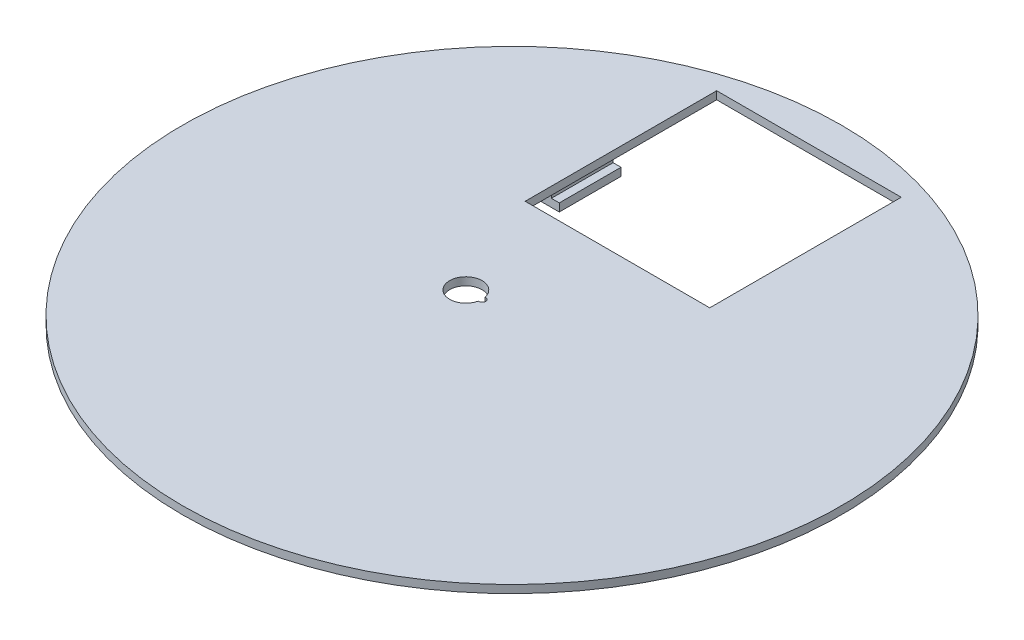
ISO-10303-21;
HEADER;
FILE_DESCRIPTION(('STEP AP214'),'2;1');
FILE_NAME('part.step','',(''),(''),'','','');
FILE_SCHEMA(('AUTOMOTIVE_DESIGN { 1 0 10303 214 1 1 1 1 }'));
ENDSEC;
DATA;
#1=APPLICATION_CONTEXT('core data for automotive mechanical design processes');
#2=APPLICATION_PROTOCOL_DEFINITION('international standard','automotive_design',2000,#1);
#3=PRODUCT_CONTEXT('',#1,'mechanical');
#4=PRODUCT('Part','Part','',(#3));
#5=PRODUCT_RELATED_PRODUCT_CATEGORY('part','',(#4));
#6=PRODUCT_DEFINITION_FORMATION('','',#4);
#7=PRODUCT_DEFINITION_CONTEXT('part definition',#1,'design');
#8=PRODUCT_DEFINITION('design','',#6,#7);
#9=PRODUCT_DEFINITION_SHAPE('','',#8);
#10=(LENGTH_UNIT() NAMED_UNIT(*) SI_UNIT(.MILLI.,.METRE.));
#11=(NAMED_UNIT(*) PLANE_ANGLE_UNIT() SI_UNIT($,.RADIAN.));
#12=(NAMED_UNIT(*) SI_UNIT($,.STERADIAN.) SOLID_ANGLE_UNIT());
#13=UNCERTAINTY_MEASURE_WITH_UNIT(LENGTH_MEASURE(1.E-05),#10,'distance_accuracy_value','');
#14=(GEOMETRIC_REPRESENTATION_CONTEXT(3) GLOBAL_UNCERTAINTY_ASSIGNED_CONTEXT((#13)) GLOBAL_UNIT_ASSIGNED_CONTEXT((#10,
#11,#12)) REPRESENTATION_CONTEXT('',''));
#15=CARTESIAN_POINT('',(0.,0.,0.));
#16=DIRECTION('',(0.,0.,1.));
#17=DIRECTION('',(1.,0.,0.));
#18=AXIS2_PLACEMENT_3D('',#15,#16,#17);
#19=CARTESIAN_POINT('',(0.,3.,-112.635569234718));
#20=DIRECTION('',(0.,0.,-1.));
#21=DIRECTION('',(-1.,0.,0.));
#22=AXIS2_PLACEMENT_3D('',#19,#20,#21);
#23=PLANE('',#22);
#24=DIRECTION('',(1.,0.,0.));
#25=VECTOR('',#24,1.);
#26=CARTESIAN_POINT('',(0.,0.,-112.635569234718));
#27=LINE('',#26,#25);
#28=CARTESIAN_POINT('',(-35.,0.,-112.635569234718));
#29=VERTEX_POINT('',#28);
#30=CARTESIAN_POINT('',(35.,0.,-112.635569234718));
#31=VERTEX_POINT('',#30);
#32=EDGE_CURVE('E197',#29,#31,#27,.T.);
#33=ORIENTED_EDGE('',*,*,#32,.T.);
#34=DIRECTION('',(0.,-1.,0.));
#35=VECTOR('',#34,1.);
#36=CARTESIAN_POINT('',(35.,3.,-112.635569234718));
#37=LINE('',#36,#35);
#38=CARTESIAN_POINT('',(35.,3.,-112.635569234718));
#39=VERTEX_POINT('',#38);
#40=EDGE_CURVE('E44',#39,#31,#37,.T.);
#41=ORIENTED_EDGE('',*,*,#40,.F.);
#42=DIRECTION('',(1.,0.,0.));
#43=VECTOR('',#42,1.);
#44=CARTESIAN_POINT('',(0.,3.,-112.635569234718));
#45=LINE('',#44,#43);
#46=CARTESIAN_POINT('',(-35.,3.,-112.635569234718));
#47=VERTEX_POINT('',#46);
#48=EDGE_CURVE('E198',#47,#39,#45,.T.);
#49=ORIENTED_EDGE('',*,*,#48,.F.);
#50=DIRECTION('',(0.,-1.,0.));
#51=VECTOR('',#50,1.);
#52=CARTESIAN_POINT('',(-35.,3.,-112.635569234718));
#53=LINE('',#52,#51);
#54=EDGE_CURVE('E213',#47,#29,#53,.T.);
#55=ORIENTED_EDGE('',*,*,#54,.T.);
#56=EDGE_LOOP('',(#33,#41,#49,#55));
#57=FACE_BOUND('',#56,.T.);
#58=ADVANCED_FACE('F37',(#57),#23,.F.);
#59=CARTESIAN_POINT('',(35.,3.,0.));
#60=DIRECTION('',(1.,0.,0.));
#61=DIRECTION('',(0.,0.,-1.));
#62=AXIS2_PLACEMENT_3D('',#59,#60,#61);
#63=PLANE('',#62);
#64=DIRECTION('',(0.,0.,1.));
#65=VECTOR('',#64,1.);
#66=CARTESIAN_POINT('',(35.,0.,0.));
#67=LINE('',#66,#65);
#68=CARTESIAN_POINT('',(35.,0.,-40.));
#69=VERTEX_POINT('',#68);
#70=EDGE_CURVE('E216',#31,#69,#67,.T.);
#71=ORIENTED_EDGE('',*,*,#70,.T.);
#72=DIRECTION('',(0.,-1.,0.));
#73=VECTOR('',#72,1.);
#74=CARTESIAN_POINT('',(35.,3.,-40.));
#75=LINE('',#74,#73);
#76=CARTESIAN_POINT('',(35.,3.,-40.));
#77=VERTEX_POINT('',#76);
#78=EDGE_CURVE('E230',#77,#69,#75,.T.);
#79=ORIENTED_EDGE('',*,*,#78,.F.);
#80=DIRECTION('',(0.,0.,1.));
#81=VECTOR('',#80,1.);
#82=CARTESIAN_POINT('',(35.,3.,0.));
#83=LINE('',#82,#81);
#84=EDGE_CURVE('E201',#39,#77,#83,.T.);
#85=ORIENTED_EDGE('',*,*,#84,.F.);
#86=ORIENTED_EDGE('',*,*,#40,.T.);
#87=EDGE_LOOP('',(#71,#79,#85,#86));
#88=FACE_BOUND('',#87,.T.);
#89=ADVANCED_FACE('F234',(#88),#63,.F.);
#90=CARTESIAN_POINT('',(0.,3.,-40.));
#91=DIRECTION('',(0.,0.,-1.));
#92=DIRECTION('',(-1.,0.,0.));
#93=AXIS2_PLACEMENT_3D('',#90,#91,#92);
#94=PLANE('',#93);
#95=DIRECTION('',(1.,0.,0.));
#96=VECTOR('',#95,1.);
#97=CARTESIAN_POINT('',(0.,0.,-40.));
#98=LINE('',#97,#96);
#99=CARTESIAN_POINT('',(-35.,0.,-40.));
#100=VERTEX_POINT('',#99);
#101=EDGE_CURVE('E219',#100,#69,#98,.T.);
#102=ORIENTED_EDGE('',*,*,#101,.F.);
#103=DIRECTION('',(0.,-1.,0.));
#104=VECTOR('',#103,1.);
#105=CARTESIAN_POINT('',(-35.,3.,-40.));
#106=LINE('',#105,#104);
#107=CARTESIAN_POINT('',(-35.,3.,-40.));
#108=VERTEX_POINT('',#107);
#109=EDGE_CURVE('E228',#108,#100,#106,.T.);
#110=ORIENTED_EDGE('',*,*,#109,.F.);
#111=DIRECTION('',(1.,0.,0.));
#112=VECTOR('',#111,1.);
#113=CARTESIAN_POINT('',(0.,3.,-40.));
#114=LINE('',#113,#112);
#115=EDGE_CURVE('E204',#108,#77,#114,.T.);
#116=ORIENTED_EDGE('',*,*,#115,.T.);
#117=ORIENTED_EDGE('',*,*,#78,.T.);
#118=EDGE_LOOP('',(#102,#110,#116,#117));
#119=FACE_BOUND('',#118,.T.);
#120=ADVANCED_FACE('F249',(#119),#94,.T.);
#121=CARTESIAN_POINT('',(-35.,3.,0.));
#122=DIRECTION('',(1.,0.,0.));
#123=DIRECTION('',(0.,0.,-1.));
#124=AXIS2_PLACEMENT_3D('',#121,#122,#123);
#125=PLANE('',#124);
#126=DIRECTION('',(0.,0.,1.));
#127=VECTOR('',#126,1.);
#128=CARTESIAN_POINT('',(-35.,0.,0.));
#129=LINE('',#128,#127);
#130=EDGE_CURVE('E222',#29,#100,#129,.T.);
#131=ORIENTED_EDGE('',*,*,#130,.F.);
#132=ORIENTED_EDGE('',*,*,#54,.F.);
#133=DIRECTION('',(0.,0.,1.));
#134=VECTOR('',#133,1.);
#135=CARTESIAN_POINT('',(-35.,3.,0.));
#136=LINE('',#135,#134);
#137=EDGE_CURVE('E207',#47,#108,#136,.T.);
#138=ORIENTED_EDGE('',*,*,#137,.T.);
#139=ORIENTED_EDGE('',*,*,#109,.T.);
#140=EDGE_LOOP('',(#131,#132,#138,#139));
#141=FACE_BOUND('',#140,.T.);
#142=ADVANCED_FACE('F244',(#141),#125,.T.);
#143=CARTESIAN_POINT('',(0.,3.,0.));
#144=DIRECTION('',(0.,-1.,0.));
#145=DIRECTION('',(0.,0.,-1.));
#146=AXIS2_PLACEMENT_3D('',#143,#144,#145);
#147=CYLINDRICAL_SURFACE('',#146,125.);
#148=CARTESIAN_POINT('',(0.,3.,0.));
#149=DIRECTION('',(0.,1.,0.));
#150=DIRECTION('',(0.,0.,1.));
#151=AXIS2_PLACEMENT_3D('',#148,#149,#150);
#152=CIRCLE('',#151,125.);
#153=CARTESIAN_POINT('',(0.,3.,125.));
#154=VERTEX_POINT('',#153);
#155=EDGE_CURVE('E210',#154,#154,#152,.T.);
#156=ORIENTED_EDGE('',*,*,#155,.F.);
#157=EDGE_LOOP('',(#156));
#158=FACE_BOUND('',#157,.T.);
#159=CARTESIAN_POINT('',(0.,0.,0.));
#160=DIRECTION('',(0.,1.,0.));
#161=DIRECTION('',(0.,0.,1.));
#162=AXIS2_PLACEMENT_3D('',#159,#160,#161);
#163=CIRCLE('',#162,125.);
#164=CARTESIAN_POINT('',(0.,0.,125.));
#165=VERTEX_POINT('',#164);
#166=EDGE_CURVE('E202',#165,#165,#163,.T.);
#167=ORIENTED_EDGE('',*,*,#166,.T.);
#168=EDGE_LOOP('',(#167));
#169=FACE_BOUND('',#168,.T.);
#170=ADVANCED_FACE('F252',(#158,#169),#147,.T.);
#171=CARTESIAN_POINT('',(0.,3.,0.));
#172=DIRECTION('',(0.,1.,0.));
#173=DIRECTION('',(0.,0.,1.));
#174=AXIS2_PLACEMENT_3D('',#171,#172,#173);
#175=PLANE('',#174);
#176=CARTESIAN_POINT('',(-10.8685777282687,3.,0.383836140495863));
#177=DIRECTION('',(0.,-1.,0.));
#178=DIRECTION('',(0.,0.,-1.));
#179=AXIS2_PLACEMENT_3D('',#176,#177,#178);
#180=CIRCLE('',#179,1.27500000000001);
#181=CARTESIAN_POINT('',(-11.0978277282688,3.,-0.870384508951437));
#182=VERTEX_POINT('',#181);
#183=CARTESIAN_POINT('',(-11.0978277282687,3.,1.63805678994317));
#184=VERTEX_POINT('',#183);
#185=EDGE_CURVE('E51',#182,#184,#180,.T.);
#186=ORIENTED_EDGE('',*,*,#185,.T.);
#187=CARTESIAN_POINT('',(-17.1185777282687,3.,0.383836140495898));
#188=DIRECTION('',(0.,-1.,0.));
#189=DIRECTION('',(0.,0.,-1.));
#190=AXIS2_PLACEMENT_3D('',#187,#188,#189);
#191=CIRCLE('',#190,6.15);
#192=EDGE_CURVE('E128',#184,#182,#191,.T.);
#193=ORIENTED_EDGE('',*,*,#192,.T.);
#194=EDGE_LOOP('',(#186,#193));
#195=FACE_BOUND('',#194,.T.);
#196=ORIENTED_EDGE('',*,*,#48,.T.);
#197=ORIENTED_EDGE('',*,*,#84,.T.);
#198=ORIENTED_EDGE('',*,*,#115,.F.);
#199=ORIENTED_EDGE('',*,*,#137,.F.);
#200=EDGE_LOOP('',(#196,#197,#198,#199));
#201=FACE_BOUND('',#200,.T.);
#202=ORIENTED_EDGE('',*,*,#155,.T.);
#203=EDGE_LOOP('',(#202));
#204=FACE_BOUND('',#203,.T.);
#205=ADVANCED_FACE('F134',(#195,#201,#204),#175,.T.);
#206=CARTESIAN_POINT('',(0.,0.,0.));
#207=DIRECTION('',(0.,1.,0.));
#208=DIRECTION('',(0.,0.,1.));
#209=AXIS2_PLACEMENT_3D('',#206,#207,#208);
#210=PLANE('',#209);
#211=CARTESIAN_POINT('',(-17.1185777282687,0.,0.383836140495898));
#212=DIRECTION('',(0.,-1.,0.));
#213=DIRECTION('',(0.,0.,-1.));
#214=AXIS2_PLACEMENT_3D('',#211,#212,#213);
#215=CIRCLE('',#214,6.15);
#216=CARTESIAN_POINT('',(-11.0978277282687,0.,1.63805678994317));
#217=VERTEX_POINT('',#216);
#218=CARTESIAN_POINT('',(-11.0978277282688,0.,-0.870384508951437));
#219=VERTEX_POINT('',#218);
#220=EDGE_CURVE('E136',#217,#219,#215,.T.);
#221=ORIENTED_EDGE('',*,*,#220,.F.);
#222=CARTESIAN_POINT('',(-10.8685777282687,0.,0.383836140495863));
#223=DIRECTION('',(0.,-1.,0.));
#224=DIRECTION('',(0.,0.,-1.));
#225=AXIS2_PLACEMENT_3D('',#222,#223,#224);
#226=CIRCLE('',#225,1.27500000000001);
#227=EDGE_CURVE('E56',#219,#217,#226,.T.);
#228=ORIENTED_EDGE('',*,*,#227,.F.);
#229=EDGE_LOOP('',(#221,#228));
#230=FACE_BOUND('',#229,.T.);
#231=CARTESIAN_POINT('',(4.31860462471146,0.,-2.10261320471408));
#232=DIRECTION('',(0.,1.,0.));
#233=DIRECTION('',(0.,0.,1.));
#234=AXIS2_PLACEMENT_3D('',#231,#232,#233);
#235=CIRCLE('',#234,2.5);
#236=CARTESIAN_POINT('',(4.31860462471146,0.,0.397386795285918));
#237=VERTEX_POINT('',#236);
#238=EDGE_CURVE('E11',#237,#237,#235,.F.);
#239=ORIENTED_EDGE('',*,*,#238,.F.);
#240=EDGE_LOOP('',(#239));
#241=FACE_BOUND('',#240,.T.);
#242=DIRECTION('',(-1.,0.,0.));
#243=VECTOR('',#242,1.);
#244=CARTESIAN_POINT('',(0.,0.,-52.9352176621956));
#245=LINE('',#244,#243);
#246=CARTESIAN_POINT('',(-38.,0.,-52.9352176621956));
#247=VERTEX_POINT('',#246);
#248=CARTESIAN_POINT('',(-42.,0.,-52.9352176621956));
#249=VERTEX_POINT('',#248);
#250=EDGE_CURVE('E182',#247,#249,#245,.T.);
#251=ORIENTED_EDGE('',*,*,#250,.F.);
#252=DIRECTION('',(0.,0.,-1.));
#253=VECTOR('',#252,1.);
#254=CARTESIAN_POINT('',(-38.,0.,0.));
#255=LINE('',#254,#253);
#256=CARTESIAN_POINT('',(-38.,0.,-76.3503547431128));
#257=VERTEX_POINT('',#256);
#258=EDGE_CURVE('E172',#247,#257,#255,.T.);
#259=ORIENTED_EDGE('',*,*,#258,.T.);
#260=DIRECTION('',(-1.,0.,0.));
#261=VECTOR('',#260,1.);
#262=CARTESIAN_POINT('',(0.,0.,-76.3503547431128));
#263=LINE('',#262,#261);
#264=CARTESIAN_POINT('',(-42.,0.,-76.3503547431128));
#265=VERTEX_POINT('',#264);
#266=EDGE_CURVE('E179',#257,#265,#263,.T.);
#267=ORIENTED_EDGE('',*,*,#266,.T.);
#268=DIRECTION('',(0.,0.,-1.));
#269=VECTOR('',#268,1.);
#270=CARTESIAN_POINT('',(-42.,0.,0.));
#271=LINE('',#270,#269);
#272=EDGE_CURVE('E184',#249,#265,#271,.T.);
#273=ORIENTED_EDGE('',*,*,#272,.F.);
#274=EDGE_LOOP('',(#251,#259,#267,#273));
#275=FACE_BOUND('',#274,.T.);
#276=ORIENTED_EDGE('',*,*,#32,.F.);
#277=ORIENTED_EDGE('',*,*,#130,.T.);
#278=ORIENTED_EDGE('',*,*,#101,.T.);
#279=ORIENTED_EDGE('',*,*,#70,.F.);
#280=EDGE_LOOP('',(#276,#277,#278,#279));
#281=FACE_BOUND('',#280,.T.);
#282=ORIENTED_EDGE('',*,*,#166,.F.);
#283=EDGE_LOOP('',(#282));
#284=FACE_BOUND('',#283,.T.);
#285=ADVANCED_FACE('F241',(#230,#241,#275,#281,#284),#210,.F.);
#286=CARTESIAN_POINT('',(-38.,-4.,0.));
#287=DIRECTION('',(1.,0.,0.));
#288=DIRECTION('',(0.,0.,-1.));
#289=AXIS2_PLACEMENT_3D('',#286,#287,#288);
#290=PLANE('',#289);
#291=ORIENTED_EDGE('',*,*,#258,.F.);
#292=DIRECTION('',(0.,1.,0.));
#293=VECTOR('',#292,1.);
#294=CARTESIAN_POINT('',(-38.,-4.,-52.9352176621956));
#295=LINE('',#294,#293);
#296=CARTESIAN_POINT('',(-38.,-4.,-52.9352176621956));
#297=VERTEX_POINT('',#296);
#298=EDGE_CURVE('E195',#297,#247,#295,.T.);
#299=ORIENTED_EDGE('',*,*,#298,.F.);
#300=DIRECTION('',(0.,0.,-1.));
#301=VECTOR('',#300,1.);
#302=CARTESIAN_POINT('',(-38.,-4.,0.));
#303=LINE('',#302,#301);
#304=CARTESIAN_POINT('',(-38.,-4.,-76.3503547431128));
#305=VERTEX_POINT('',#304);
#306=EDGE_CURVE('E175',#297,#305,#303,.T.);
#307=ORIENTED_EDGE('',*,*,#306,.T.);
#308=DIRECTION('',(0.,1.,0.));
#309=VECTOR('',#308,1.);
#310=CARTESIAN_POINT('',(-38.,-4.,-76.3503547431128));
#311=LINE('',#310,#309);
#312=EDGE_CURVE('E178',#305,#257,#311,.T.);
#313=ORIENTED_EDGE('',*,*,#312,.T.);
#314=EDGE_LOOP('',(#291,#299,#307,#313));
#315=FACE_BOUND('',#314,.T.);
#316=ADVANCED_FACE('F261',(#315),#290,.T.);
#317=CARTESIAN_POINT('',(0.,-4.,-52.9352176621956));
#318=DIRECTION('',(0.,0.,-1.));
#319=DIRECTION('',(-1.,0.,0.));
#320=AXIS2_PLACEMENT_3D('',#317,#318,#319);
#321=PLANE('',#320);
#322=ORIENTED_EDGE('',*,*,#250,.T.);
#323=DIRECTION('',(0.,1.,0.));
#324=VECTOR('',#323,1.);
#325=CARTESIAN_POINT('',(-42.,-4.,-52.9352176621956));
#326=LINE('',#325,#324);
#327=CARTESIAN_POINT('',(-42.,-7.,-52.9352176621956));
#328=VERTEX_POINT('',#327);
#329=EDGE_CURVE('E192',#328,#249,#326,.T.);
#330=ORIENTED_EDGE('',*,*,#329,.F.);
#331=DIRECTION('',(1.,0.,0.));
#332=VECTOR('',#331,1.);
#333=CARTESIAN_POINT('',(0.,-7.,-52.9352176621956));
#334=LINE('',#333,#332);
#335=CARTESIAN_POINT('',(-35.,-7.,-52.9352176621956));
#336=VERTEX_POINT('',#335);
#337=EDGE_CURVE('E152',#328,#336,#334,.T.);
#338=ORIENTED_EDGE('',*,*,#337,.T.);
#339=DIRECTION('',(0.,1.,0.));
#340=VECTOR('',#339,1.);
#341=CARTESIAN_POINT('',(-35.,-7.,-52.9352176621956));
#342=LINE('',#341,#340);
#343=CARTESIAN_POINT('',(-35.,-4.,-52.9352176621956));
#344=VERTEX_POINT('',#343);
#345=EDGE_CURVE('E163',#336,#344,#342,.T.);
#346=ORIENTED_EDGE('',*,*,#345,.T.);
#347=DIRECTION('',(1.,0.,0.));
#348=VECTOR('',#347,1.);
#349=CARTESIAN_POINT('',(0.,-4.,-52.9352176621956));
#350=LINE('',#349,#348);
#351=EDGE_CURVE('E151',#297,#344,#350,.T.);
#352=ORIENTED_EDGE('',*,*,#351,.F.);
#353=ORIENTED_EDGE('',*,*,#298,.T.);
#354=EDGE_LOOP('',(#322,#330,#338,#346,#352,#353));
#355=FACE_BOUND('',#354,.T.);
#356=ADVANCED_FACE('F267',(#355),#321,.F.);
#357=CARTESIAN_POINT('',(-42.,-4.,0.));
#358=DIRECTION('',(1.,0.,0.));
#359=DIRECTION('',(0.,0.,-1.));
#360=AXIS2_PLACEMENT_3D('',#357,#358,#359);
#361=PLANE('',#360);
#362=ORIENTED_EDGE('',*,*,#272,.T.);
#363=DIRECTION('',(0.,1.,0.));
#364=VECTOR('',#363,1.);
#365=CARTESIAN_POINT('',(-42.,-4.,-76.3503547431128));
#366=LINE('',#365,#364);
#367=CARTESIAN_POINT('',(-42.,-7.,-76.3503547431128));
#368=VERTEX_POINT('',#367);
#369=EDGE_CURVE('E189',#368,#265,#366,.T.);
#370=ORIENTED_EDGE('',*,*,#369,.F.);
#371=DIRECTION('',(0.,0.,1.));
#372=VECTOR('',#371,1.);
#373=CARTESIAN_POINT('',(-42.,-7.,0.));
#374=LINE('',#373,#372);
#375=EDGE_CURVE('E160',#368,#328,#374,.T.);
#376=ORIENTED_EDGE('',*,*,#375,.T.);
#377=ORIENTED_EDGE('',*,*,#329,.T.);
#378=EDGE_LOOP('',(#362,#370,#376,#377));
#379=FACE_BOUND('',#378,.T.);
#380=ADVANCED_FACE('F355',(#379),#361,.F.);
#381=CARTESIAN_POINT('',(0.,-4.,-76.3503547431128));
#382=DIRECTION('',(0.,0.,-1.));
#383=DIRECTION('',(-1.,0.,0.));
#384=AXIS2_PLACEMENT_3D('',#381,#382,#383);
#385=PLANE('',#384);
#386=ORIENTED_EDGE('',*,*,#266,.F.);
#387=ORIENTED_EDGE('',*,*,#312,.F.);
#388=DIRECTION('',(1.,0.,0.));
#389=VECTOR('',#388,1.);
#390=CARTESIAN_POINT('',(0.,-4.,-76.3503547431128));
#391=LINE('',#390,#389);
#392=CARTESIAN_POINT('',(-35.,-4.,-76.3503547431128));
#393=VERTEX_POINT('',#392);
#394=EDGE_CURVE('E156',#305,#393,#391,.T.);
#395=ORIENTED_EDGE('',*,*,#394,.T.);
#396=DIRECTION('',(0.,1.,0.));
#397=VECTOR('',#396,1.);
#398=CARTESIAN_POINT('',(-35.,-7.,-76.3503547431128));
#399=LINE('',#398,#397);
#400=CARTESIAN_POINT('',(-35.,-7.,-76.3503547431128));
#401=VERTEX_POINT('',#400);
#402=EDGE_CURVE('E169',#401,#393,#399,.T.);
#403=ORIENTED_EDGE('',*,*,#402,.F.);
#404=DIRECTION('',(1.,0.,0.));
#405=VECTOR('',#404,1.);
#406=CARTESIAN_POINT('',(0.,-7.,-76.3503547431128));
#407=LINE('',#406,#405);
#408=EDGE_CURVE('E158',#368,#401,#407,.T.);
#409=ORIENTED_EDGE('',*,*,#408,.F.);
#410=ORIENTED_EDGE('',*,*,#369,.T.);
#411=EDGE_LOOP('',(#386,#387,#395,#403,#409,#410));
#412=FACE_BOUND('',#411,.T.);
#413=ADVANCED_FACE('F351',(#412),#385,.T.);
#414=CARTESIAN_POINT('',(-35.,-7.,0.));
#415=DIRECTION('',(-1.,0.,0.));
#416=DIRECTION('',(0.,0.,1.));
#417=AXIS2_PLACEMENT_3D('',#414,#415,#416);
#418=PLANE('',#417);
#419=DIRECTION('',(0.,0.,1.));
#420=VECTOR('',#419,1.);
#421=CARTESIAN_POINT('',(-35.,-4.,0.));
#422=LINE('',#421,#420);
#423=EDGE_CURVE('E165',#393,#344,#422,.T.);
#424=ORIENTED_EDGE('',*,*,#423,.T.);
#425=ORIENTED_EDGE('',*,*,#345,.F.);
#426=DIRECTION('',(0.,0.,1.));
#427=VECTOR('',#426,1.);
#428=CARTESIAN_POINT('',(-35.,-7.,0.));
#429=LINE('',#428,#427);
#430=EDGE_CURVE('E155',#401,#336,#429,.T.);
#431=ORIENTED_EDGE('',*,*,#430,.F.);
#432=ORIENTED_EDGE('',*,*,#402,.T.);
#433=EDGE_LOOP('',(#424,#425,#431,#432));
#434=FACE_BOUND('',#433,.T.);
#435=ADVANCED_FACE('F344',(#434),#418,.F.);
#436=CARTESIAN_POINT('',(0.,-7.,0.));
#437=DIRECTION('',(0.,-1.,0.));
#438=DIRECTION('',(0.,0.,-1.));
#439=AXIS2_PLACEMENT_3D('',#436,#437,#438);
#440=PLANE('',#439);
#441=ORIENTED_EDGE('',*,*,#337,.F.);
#442=ORIENTED_EDGE('',*,*,#375,.F.);
#443=ORIENTED_EDGE('',*,*,#408,.T.);
#444=ORIENTED_EDGE('',*,*,#430,.T.);
#445=EDGE_LOOP('',(#441,#442,#443,#444));
#446=FACE_BOUND('',#445,.T.);
#447=ADVANCED_FACE('F341',(#446),#440,.T.);
#448=CARTESIAN_POINT('',(0.,-4.,0.));
#449=DIRECTION('',(0.,-1.,0.));
#450=DIRECTION('',(0.,0.,-1.));
#451=AXIS2_PLACEMENT_3D('',#448,#449,#450);
#452=PLANE('',#451);
#453=ORIENTED_EDGE('',*,*,#306,.F.);
#454=ORIENTED_EDGE('',*,*,#351,.T.);
#455=ORIENTED_EDGE('',*,*,#423,.F.);
#456=ORIENTED_EDGE('',*,*,#394,.F.);
#457=EDGE_LOOP('',(#453,#454,#455,#456));
#458=FACE_BOUND('',#457,.T.);
#459=ADVANCED_FACE('F339',(#458),#452,.F.);
#460=CARTESIAN_POINT('',(4.31860462471146,-3.,-2.10261320471408));
#461=DIRECTION('',(0.,1.,0.));
#462=DIRECTION('',(0.,0.,1.));
#463=AXIS2_PLACEMENT_3D('',#460,#461,#462);
#464=CYLINDRICAL_SURFACE('',#463,2.5);
#465=CARTESIAN_POINT('',(4.31860462471146,-3.,-2.10261320471408));
#466=DIRECTION('',(0.,-1.,0.));
#467=DIRECTION('',(0.,0.,-1.));
#468=AXIS2_PLACEMENT_3D('',#465,#466,#467);
#469=CIRCLE('',#468,2.5);
#470=CARTESIAN_POINT('',(4.31860462471146,-3.,-4.60261320471408));
#471=VERTEX_POINT('',#470);
#472=EDGE_CURVE('E146',#471,#471,#469,.T.);
#473=ORIENTED_EDGE('',*,*,#472,.F.);
#474=EDGE_LOOP('',(#473));
#475=FACE_BOUND('',#474,.T.);
#476=ORIENTED_EDGE('',*,*,#238,.T.);
#477=EDGE_LOOP('',(#476));
#478=FACE_BOUND('',#477,.T.);
#479=ADVANCED_FACE('F335',(#475,#478),#464,.T.);
#480=CARTESIAN_POINT('',(4.31860462471146,-6.,-2.10261320471408));
#481=DIRECTION('',(0.,1.,0.));
#482=DIRECTION('',(0.,0.,1.));
#483=AXIS2_PLACEMENT_3D('',#480,#481,#482);
#484=CYLINDRICAL_SURFACE('',#483,4.5);
#485=CARTESIAN_POINT('',(4.31860462471146,-6.,-2.10261320471408));
#486=DIRECTION('',(0.,-1.,0.));
#487=DIRECTION('',(0.,0.,-1.));
#488=AXIS2_PLACEMENT_3D('',#485,#486,#487);
#489=CIRCLE('',#488,4.5);
#490=CARTESIAN_POINT('',(4.31860462471146,-6.,-6.60261320471408));
#491=VERTEX_POINT('',#490);
#492=EDGE_CURVE('E143',#491,#491,#489,.T.);
#493=ORIENTED_EDGE('',*,*,#492,.F.);
#494=EDGE_LOOP('',(#493));
#495=FACE_BOUND('',#494,.T.);
#496=CARTESIAN_POINT('',(4.31860462471146,-3.,-2.10261320471408));
#497=DIRECTION('',(0.,-1.,0.));
#498=DIRECTION('',(0.,0.,-1.));
#499=AXIS2_PLACEMENT_3D('',#496,#497,#498);
#500=CIRCLE('',#499,4.5);
#501=CARTESIAN_POINT('',(4.31860462471146,-3.,-6.60261320471408));
#502=VERTEX_POINT('',#501);
#503=EDGE_CURVE('E141',#502,#502,#500,.T.);
#504=ORIENTED_EDGE('',*,*,#503,.T.);
#505=EDGE_LOOP('',(#504));
#506=FACE_BOUND('',#505,.T.);
#507=ADVANCED_FACE('F329',(#495,#506),#484,.T.);
#508=CARTESIAN_POINT('',(0.,-6.,0.));
#509=DIRECTION('',(0.,-1.,0.));
#510=DIRECTION('',(0.,0.,-1.));
#511=AXIS2_PLACEMENT_3D('',#508,#509,#510);
#512=PLANE('',#511);
#513=ORIENTED_EDGE('',*,*,#492,.T.);
#514=EDGE_LOOP('',(#513));
#515=FACE_BOUND('',#514,.T.);
#516=ADVANCED_FACE('F326',(#515),#512,.T.);
#517=CARTESIAN_POINT('',(0.,-3.,0.));
#518=DIRECTION('',(0.,-1.,0.));
#519=DIRECTION('',(0.,0.,-1.));
#520=AXIS2_PLACEMENT_3D('',#517,#518,#519);
#521=PLANE('',#520);
#522=ORIENTED_EDGE('',*,*,#472,.T.);
#523=EDGE_LOOP('',(#522));
#524=FACE_BOUND('',#523,.T.);
#525=ORIENTED_EDGE('',*,*,#503,.F.);
#526=EDGE_LOOP('',(#525));
#527=FACE_BOUND('',#526,.T.);
#528=ADVANCED_FACE('F300',(#524,#527),#521,.F.);
#529=CARTESIAN_POINT('',(-10.8685777282687,3.,0.383836140495863));
#530=DIRECTION('',(0.,-1.,0.));
#531=DIRECTION('',(0.,0.,-1.));
#532=AXIS2_PLACEMENT_3D('',#529,#530,#531);
#533=CYLINDRICAL_SURFACE('',#532,1.27500000000001);
#534=ORIENTED_EDGE('',*,*,#227,.T.);
#535=DIRECTION('',(0.,-1.,0.));
#536=VECTOR('',#535,1.);
#537=CARTESIAN_POINT('',(-11.0978277282687,3.,1.63805678994317));
#538=LINE('',#537,#536);
#539=EDGE_CURVE('E121',#184,#217,#538,.T.);
#540=ORIENTED_EDGE('',*,*,#539,.F.);
#541=ORIENTED_EDGE('',*,*,#185,.F.);
#542=DIRECTION('',(0.,-1.,0.));
#543=VECTOR('',#542,1.);
#544=CARTESIAN_POINT('',(-11.0978277282688,3.,-0.870384508951437));
#545=LINE('',#544,#543);
#546=EDGE_CURVE('E127',#182,#219,#545,.T.);
#547=ORIENTED_EDGE('',*,*,#546,.T.);
#548=EDGE_LOOP('',(#534,#540,#541,#547));
#549=FACE_BOUND('',#548,.T.);
#550=ADVANCED_FACE('F123',(#549),#533,.F.);
#551=CARTESIAN_POINT('',(-17.1185777282687,3.,0.383836140495898));
#552=DIRECTION('',(0.,-1.,0.));
#553=DIRECTION('',(0.,0.,-1.));
#554=AXIS2_PLACEMENT_3D('',#551,#552,#553);
#555=CYLINDRICAL_SURFACE('',#554,6.15);
#556=ORIENTED_EDGE('',*,*,#220,.T.);
#557=ORIENTED_EDGE('',*,*,#546,.F.);
#558=ORIENTED_EDGE('',*,*,#192,.F.);
#559=ORIENTED_EDGE('',*,*,#539,.T.);
#560=EDGE_LOOP('',(#556,#557,#558,#559));
#561=FACE_BOUND('',#560,.T.);
#562=ADVANCED_FACE('F131',(#561),#555,.F.);
#563=CLOSED_SHELL('',(#58,#89,#120,#142,#170,#205,#285,#316,#356,#380,#413,#435,#447,#459,#479,
#507,#516,#528,#550,#562));
#564=MANIFOLD_SOLID_BREP('B2',#563);
#565=ADVANCED_BREP_SHAPE_REPRESENTATION('',(#18,#564),#14);
#566=SHAPE_DEFINITION_REPRESENTATION(#9,#565);
ENDSEC;
END-ISO-10303-21;
